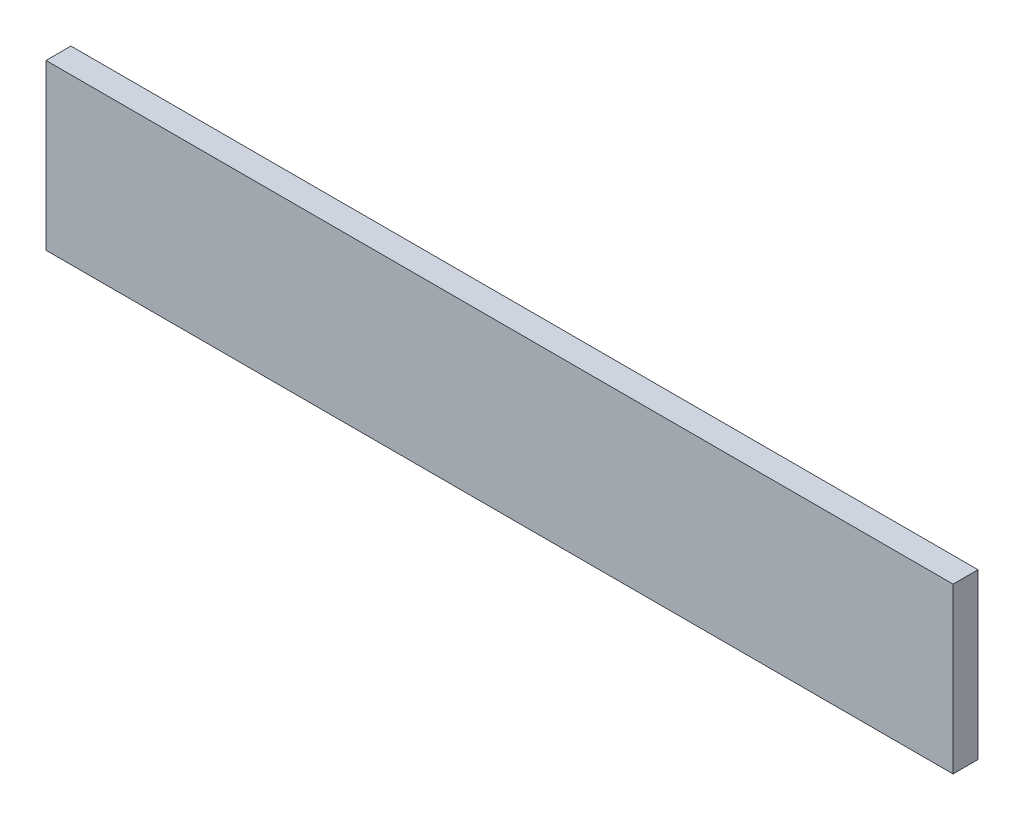
ISO-10303-21;
HEADER;
FILE_DESCRIPTION(('STEP AP214'),'2;1');
FILE_NAME('part.step','',(''),(''),'','','');
FILE_SCHEMA(('AUTOMOTIVE_DESIGN { 1 0 10303 214 1 1 1 1 }'));
ENDSEC;
DATA;
#1=APPLICATION_CONTEXT('core data for automotive mechanical design processes');
#2=APPLICATION_PROTOCOL_DEFINITION('international standard','automotive_design',2000,#1);
#3=PRODUCT_CONTEXT('',#1,'mechanical');
#4=PRODUCT('Part','Part','',(#3));
#5=PRODUCT_RELATED_PRODUCT_CATEGORY('part','',(#4));
#6=PRODUCT_DEFINITION_FORMATION('','',#4);
#7=PRODUCT_DEFINITION_CONTEXT('part definition',#1,'design');
#8=PRODUCT_DEFINITION('design','',#6,#7);
#9=PRODUCT_DEFINITION_SHAPE('','',#8);
#10=(LENGTH_UNIT() NAMED_UNIT(*) SI_UNIT(.MILLI.,.METRE.));
#11=(NAMED_UNIT(*) PLANE_ANGLE_UNIT() SI_UNIT($,.RADIAN.));
#12=(NAMED_UNIT(*) SI_UNIT($,.STERADIAN.) SOLID_ANGLE_UNIT());
#13=UNCERTAINTY_MEASURE_WITH_UNIT(LENGTH_MEASURE(1.E-05),#10,'distance_accuracy_value','');
#14=(GEOMETRIC_REPRESENTATION_CONTEXT(3) GLOBAL_UNCERTAINTY_ASSIGNED_CONTEXT((#13)) GLOBAL_UNIT_ASSIGNED_CONTEXT((#10,
#11,#12)) REPRESENTATION_CONTEXT('',''));
#15=CARTESIAN_POINT('',(0.,0.,0.));
#16=DIRECTION('',(0.,0.,1.));
#17=DIRECTION('',(1.,0.,0.));
#18=AXIS2_PLACEMENT_3D('',#15,#16,#17);
#19=CARTESIAN_POINT('',(400.,72.5,22.));
#20=DIRECTION('',(-1.,0.,0.));
#21=DIRECTION('',(0.,0.,1.));
#22=AXIS2_PLACEMENT_3D('',#19,#20,#21);
#23=PLANE('',#22);
#24=DIRECTION('',(0.,1.,0.));
#25=VECTOR('',#24,1.);
#26=CARTESIAN_POINT('',(400.,72.5,0.));
#27=LINE('',#26,#25);
#28=CARTESIAN_POINT('',(400.,-72.5,0.));
#29=VERTEX_POINT('',#28);
#30=CARTESIAN_POINT('',(400.,72.5,0.));
#31=VERTEX_POINT('',#30);
#32=EDGE_CURVE('E95',#29,#31,#27,.T.);
#33=ORIENTED_EDGE('',*,*,#32,.T.);
#34=DIRECTION('',(0.,0.,-1.));
#35=VECTOR('',#34,1.);
#36=CARTESIAN_POINT('',(400.,72.5,22.));
#37=LINE('',#36,#35);
#38=CARTESIAN_POINT('',(400.,72.5,22.));
#39=VERTEX_POINT('',#38);
#40=EDGE_CURVE('E11',#39,#31,#37,.T.);
#41=ORIENTED_EDGE('',*,*,#40,.F.);
#42=DIRECTION('',(0.,1.,0.));
#43=VECTOR('',#42,1.);
#44=CARTESIAN_POINT('',(400.,72.5,22.));
#45=LINE('',#44,#43);
#46=CARTESIAN_POINT('',(400.,-72.5,22.));
#47=VERTEX_POINT('',#46);
#48=EDGE_CURVE('E83',#47,#39,#45,.T.);
#49=ORIENTED_EDGE('',*,*,#48,.F.);
#50=DIRECTION('',(0.,0.,-1.));
#51=VECTOR('',#50,1.);
#52=CARTESIAN_POINT('',(400.,-72.5,22.));
#53=LINE('',#52,#51);
#54=EDGE_CURVE('E91',#47,#29,#53,.T.);
#55=ORIENTED_EDGE('',*,*,#54,.T.);
#56=EDGE_LOOP('',(#33,#41,#49,#55));
#57=FACE_BOUND('',#56,.T.);
#58=ADVANCED_FACE('F32',(#57),#23,.F.);
#59=CARTESIAN_POINT('',(400.,72.5,22.));
#60=DIRECTION('',(0.,-1.,0.));
#61=DIRECTION('',(0.,0.,-1.));
#62=AXIS2_PLACEMENT_3D('',#59,#60,#61);
#63=PLANE('',#62);
#64=DIRECTION('',(-1.,0.,0.));
#65=VECTOR('',#64,1.);
#66=CARTESIAN_POINT('',(400.,72.5,0.));
#67=LINE('',#66,#65);
#68=CARTESIAN_POINT('',(-400.,72.5,0.));
#69=VERTEX_POINT('',#68);
#70=EDGE_CURVE('E87',#31,#69,#67,.T.);
#71=ORIENTED_EDGE('',*,*,#70,.T.);
#72=DIRECTION('',(0.,0.,-1.));
#73=VECTOR('',#72,1.);
#74=CARTESIAN_POINT('',(-400.,72.5,22.));
#75=LINE('',#74,#73);
#76=CARTESIAN_POINT('',(-400.,72.5,22.));
#77=VERTEX_POINT('',#76);
#78=EDGE_CURVE('E40',#77,#69,#75,.T.);
#79=ORIENTED_EDGE('',*,*,#78,.F.);
#80=DIRECTION('',(-1.,0.,0.));
#81=VECTOR('',#80,1.);
#82=CARTESIAN_POINT('',(400.,72.5,22.));
#83=LINE('',#82,#81);
#84=EDGE_CURVE('E78',#39,#77,#83,.T.);
#85=ORIENTED_EDGE('',*,*,#84,.F.);
#86=ORIENTED_EDGE('',*,*,#40,.T.);
#87=EDGE_LOOP('',(#71,#79,#85,#86));
#88=FACE_BOUND('',#87,.T.);
#89=ADVANCED_FACE('F86',(#88),#63,.F.);
#90=CARTESIAN_POINT('',(-400.,72.5,22.));
#91=DIRECTION('',(1.,0.,0.));
#92=DIRECTION('',(0.,0.,-1.));
#93=AXIS2_PLACEMENT_3D('',#90,#91,#92);
#94=PLANE('',#93);
#95=DIRECTION('',(0.,-1.,0.));
#96=VECTOR('',#95,1.);
#97=CARTESIAN_POINT('',(-400.,72.5,0.));
#98=LINE('',#97,#96);
#99=CARTESIAN_POINT('',(-400.,-72.5,0.));
#100=VERTEX_POINT('',#99);
#101=EDGE_CURVE('E65',#69,#100,#98,.T.);
#102=ORIENTED_EDGE('',*,*,#101,.T.);
#103=DIRECTION('',(0.,0.,-1.));
#104=VECTOR('',#103,1.);
#105=CARTESIAN_POINT('',(-400.,-72.5,22.));
#106=LINE('',#105,#104);
#107=CARTESIAN_POINT('',(-400.,-72.5,22.));
#108=VERTEX_POINT('',#107);
#109=EDGE_CURVE('E88',#108,#100,#106,.T.);
#110=ORIENTED_EDGE('',*,*,#109,.F.);
#111=DIRECTION('',(0.,-1.,0.));
#112=VECTOR('',#111,1.);
#113=CARTESIAN_POINT('',(-400.,72.5,22.));
#114=LINE('',#113,#112);
#115=EDGE_CURVE('E81',#77,#108,#114,.T.);
#116=ORIENTED_EDGE('',*,*,#115,.F.);
#117=ORIENTED_EDGE('',*,*,#78,.T.);
#118=EDGE_LOOP('',(#102,#110,#116,#117));
#119=FACE_BOUND('',#118,.T.);
#120=ADVANCED_FACE('F89',(#119),#94,.F.);
#121=CARTESIAN_POINT('',(400.,-72.5,22.));
#122=DIRECTION('',(0.,1.,0.));
#123=DIRECTION('',(0.,0.,1.));
#124=AXIS2_PLACEMENT_3D('',#121,#122,#123);
#125=PLANE('',#124);
#126=DIRECTION('',(1.,0.,0.));
#127=VECTOR('',#126,1.);
#128=CARTESIAN_POINT('',(400.,-72.5,0.));
#129=LINE('',#128,#127);
#130=EDGE_CURVE('E71',#100,#29,#129,.T.);
#131=ORIENTED_EDGE('',*,*,#130,.T.);
#132=ORIENTED_EDGE('',*,*,#54,.F.);
#133=DIRECTION('',(1.,0.,0.));
#134=VECTOR('',#133,1.);
#135=CARTESIAN_POINT('',(400.,-72.5,22.));
#136=LINE('',#135,#134);
#137=EDGE_CURVE('E48',#108,#47,#136,.T.);
#138=ORIENTED_EDGE('',*,*,#137,.F.);
#139=ORIENTED_EDGE('',*,*,#109,.T.);
#140=EDGE_LOOP('',(#131,#132,#138,#139));
#141=FACE_BOUND('',#140,.T.);
#142=ADVANCED_FACE('F102',(#141),#125,.F.);
#143=CARTESIAN_POINT('',(400.,-72.5,22.));
#144=DIRECTION('',(0.,0.,-1.));
#145=DIRECTION('',(-1.,0.,0.));
#146=AXIS2_PLACEMENT_3D('',#143,#144,#145);
#147=PLANE('',#146);
#148=ORIENTED_EDGE('',*,*,#48,.T.);
#149=ORIENTED_EDGE('',*,*,#84,.T.);
#150=ORIENTED_EDGE('',*,*,#115,.T.);
#151=ORIENTED_EDGE('',*,*,#137,.T.);
#152=EDGE_LOOP('',(#148,#149,#150,#151));
#153=FACE_BOUND('',#152,.T.);
#154=ADVANCED_FACE('F79',(#153),#147,.F.);
#155=CARTESIAN_POINT('',(400.,-72.5,0.));
#156=DIRECTION('',(0.,0.,-1.));
#157=DIRECTION('',(-1.,0.,0.));
#158=AXIS2_PLACEMENT_3D('',#155,#156,#157);
#159=PLANE('',#158);
#160=ORIENTED_EDGE('',*,*,#32,.F.);
#161=ORIENTED_EDGE('',*,*,#130,.F.);
#162=ORIENTED_EDGE('',*,*,#101,.F.);
#163=ORIENTED_EDGE('',*,*,#70,.F.);
#164=EDGE_LOOP('',(#160,#161,#162,#163));
#165=FACE_BOUND('',#164,.T.);
#166=ADVANCED_FACE('F105',(#165),#159,.T.);
#167=CLOSED_SHELL('',(#58,#89,#120,#142,#154,#166));
#168=MANIFOLD_SOLID_BREP('B2',#167);
#169=ADVANCED_BREP_SHAPE_REPRESENTATION('',(#18,#168),#14);
#170=SHAPE_DEFINITION_REPRESENTATION(#9,#169);
ENDSEC;
END-ISO-10303-21;
